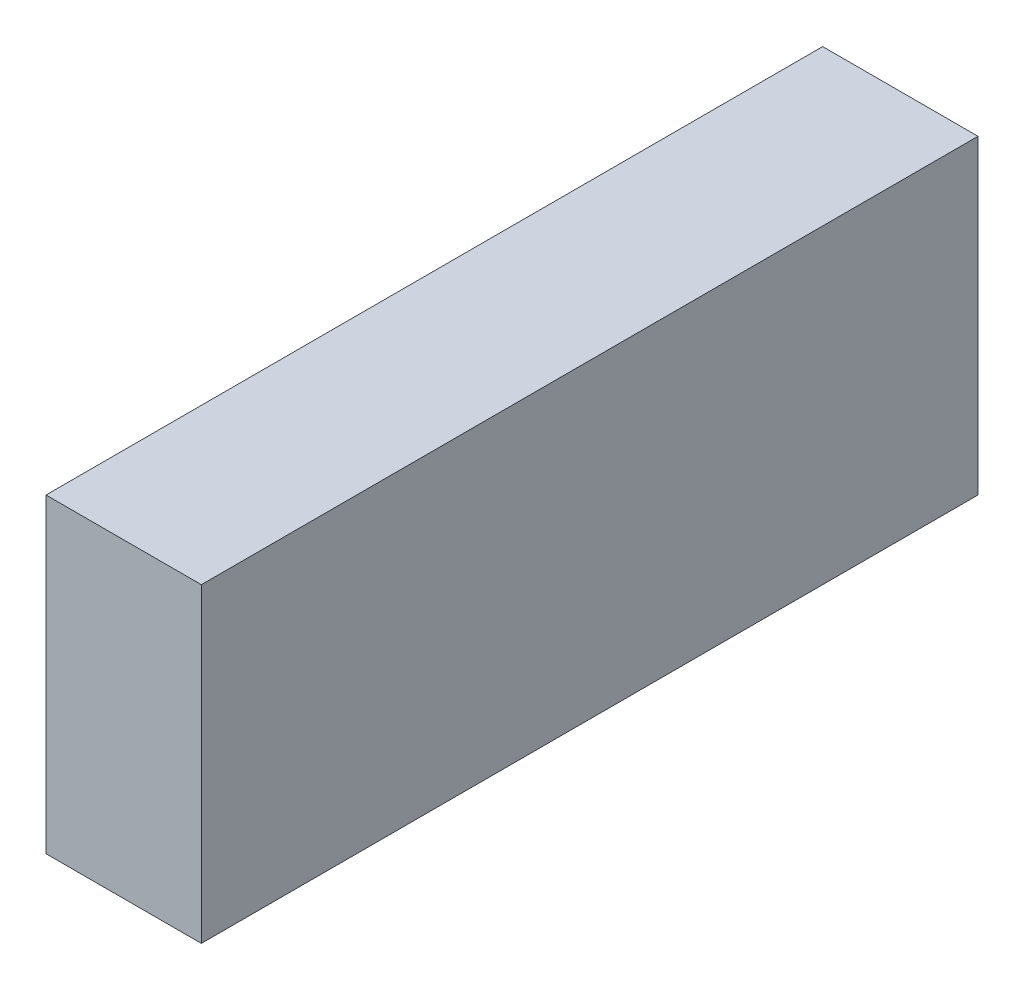
ISO-10303-21;
HEADER;
FILE_DESCRIPTION(('STEP AP214'),'2;1');
FILE_NAME('part.step','',(''),(''),'','','');
FILE_SCHEMA(('AUTOMOTIVE_DESIGN { 1 0 10303 214 1 1 1 1 }'));
ENDSEC;
DATA;
#1=APPLICATION_CONTEXT('core data for automotive mechanical design processes');
#2=APPLICATION_PROTOCOL_DEFINITION('international standard','automotive_design',2000,#1);
#3=PRODUCT_CONTEXT('',#1,'mechanical');
#4=PRODUCT('Part','Part','',(#3));
#5=PRODUCT_RELATED_PRODUCT_CATEGORY('part','',(#4));
#6=PRODUCT_DEFINITION_FORMATION('','',#4);
#7=PRODUCT_DEFINITION_CONTEXT('part definition',#1,'design');
#8=PRODUCT_DEFINITION('design','',#6,#7);
#9=PRODUCT_DEFINITION_SHAPE('','',#8);
#10=(LENGTH_UNIT() NAMED_UNIT(*) SI_UNIT(.MILLI.,.METRE.));
#11=(NAMED_UNIT(*) PLANE_ANGLE_UNIT() SI_UNIT($,.RADIAN.));
#12=(NAMED_UNIT(*) SI_UNIT($,.STERADIAN.) SOLID_ANGLE_UNIT());
#13=UNCERTAINTY_MEASURE_WITH_UNIT(LENGTH_MEASURE(1.E-05),#10,'distance_accuracy_value','');
#14=(GEOMETRIC_REPRESENTATION_CONTEXT(3) GLOBAL_UNCERTAINTY_ASSIGNED_CONTEXT((#13)) GLOBAL_UNIT_ASSIGNED_CONTEXT((#10,
#11,#12)) REPRESENTATION_CONTEXT('',''));
#15=CARTESIAN_POINT('',(0.,0.,0.));
#16=DIRECTION('',(0.,0.,1.));
#17=DIRECTION('',(1.,0.,0.));
#18=AXIS2_PLACEMENT_3D('',#15,#16,#17);
#19=CARTESIAN_POINT('',(0.,0.,50.));
#20=DIRECTION('',(1.,0.,0.));
#21=DIRECTION('',(0.,0.,-1.));
#22=AXIS2_PLACEMENT_3D('',#19,#20,#21);
#23=PLANE('',#22);
#24=DIRECTION('',(0.,-1.,0.));
#25=VECTOR('',#24,1.);
#26=CARTESIAN_POINT('',(0.,0.,0.));
#27=LINE('',#26,#25);
#28=CARTESIAN_POINT('',(0.,20.,0.));
#29=VERTEX_POINT('',#28);
#30=CARTESIAN_POINT('',(0.,0.,0.));
#31=VERTEX_POINT('',#30);
#32=EDGE_CURVE('E101',#29,#31,#27,.T.);
#33=ORIENTED_EDGE('',*,*,#32,.T.);
#34=DIRECTION('',(0.,0.,-1.));
#35=VECTOR('',#34,1.);
#36=CARTESIAN_POINT('',(0.,0.,50.));
#37=LINE('',#36,#35);
#38=CARTESIAN_POINT('',(0.,0.,50.));
#39=VERTEX_POINT('',#38);
#40=EDGE_CURVE('E12',#39,#31,#37,.T.);
#41=ORIENTED_EDGE('',*,*,#40,.F.);
#42=DIRECTION('',(0.,-1.,0.));
#43=VECTOR('',#42,1.);
#44=CARTESIAN_POINT('',(0.,0.,50.));
#45=LINE('',#44,#43);
#46=CARTESIAN_POINT('',(0.,20.,50.));
#47=VERTEX_POINT('',#46);
#48=EDGE_CURVE('E89',#47,#39,#45,.T.);
#49=ORIENTED_EDGE('',*,*,#48,.F.);
#50=DIRECTION('',(0.,0.,-1.));
#51=VECTOR('',#50,1.);
#52=CARTESIAN_POINT('',(0.,20.,50.));
#53=LINE('',#52,#51);
#54=EDGE_CURVE('E97',#47,#29,#53,.T.);
#55=ORIENTED_EDGE('',*,*,#54,.T.);
#56=EDGE_LOOP('',(#33,#41,#49,#55));
#57=FACE_BOUND('',#56,.T.);
#58=ADVANCED_FACE('F38',(#57),#23,.F.);
#59=CARTESIAN_POINT('',(0.,0.,50.));
#60=DIRECTION('',(0.,1.,0.));
#61=DIRECTION('',(0.,0.,1.));
#62=AXIS2_PLACEMENT_3D('',#59,#60,#61);
#63=PLANE('',#62);
#64=DIRECTION('',(1.,0.,0.));
#65=VECTOR('',#64,1.);
#66=CARTESIAN_POINT('',(0.,0.,0.));
#67=LINE('',#66,#65);
#68=CARTESIAN_POINT('',(10.,0.,0.));
#69=VERTEX_POINT('',#68);
#70=EDGE_CURVE('E93',#31,#69,#67,.T.);
#71=ORIENTED_EDGE('',*,*,#70,.T.);
#72=DIRECTION('',(0.,0.,-1.));
#73=VECTOR('',#72,1.);
#74=CARTESIAN_POINT('',(10.,0.,50.));
#75=LINE('',#74,#73);
#76=CARTESIAN_POINT('',(10.,0.,50.));
#77=VERTEX_POINT('',#76);
#78=EDGE_CURVE('E46',#77,#69,#75,.T.);
#79=ORIENTED_EDGE('',*,*,#78,.F.);
#80=DIRECTION('',(1.,0.,0.));
#81=VECTOR('',#80,1.);
#82=CARTESIAN_POINT('',(0.,0.,50.));
#83=LINE('',#82,#81);
#84=EDGE_CURVE('E84',#39,#77,#83,.T.);
#85=ORIENTED_EDGE('',*,*,#84,.F.);
#86=ORIENTED_EDGE('',*,*,#40,.T.);
#87=EDGE_LOOP('',(#71,#79,#85,#86));
#88=FACE_BOUND('',#87,.T.);
#89=ADVANCED_FACE('F92',(#88),#63,.F.);
#90=CARTESIAN_POINT('',(10.,0.,50.));
#91=DIRECTION('',(-1.,0.,0.));
#92=DIRECTION('',(0.,0.,1.));
#93=AXIS2_PLACEMENT_3D('',#90,#91,#92);
#94=PLANE('',#93);
#95=DIRECTION('',(0.,1.,0.));
#96=VECTOR('',#95,1.);
#97=CARTESIAN_POINT('',(10.,0.,0.));
#98=LINE('',#97,#96);
#99=CARTESIAN_POINT('',(10.,20.,0.));
#100=VERTEX_POINT('',#99);
#101=EDGE_CURVE('E71',#69,#100,#98,.T.);
#102=ORIENTED_EDGE('',*,*,#101,.T.);
#103=DIRECTION('',(0.,0.,-1.));
#104=VECTOR('',#103,1.);
#105=CARTESIAN_POINT('',(10.,20.,50.));
#106=LINE('',#105,#104);
#107=CARTESIAN_POINT('',(10.,20.,50.));
#108=VERTEX_POINT('',#107);
#109=EDGE_CURVE('E94',#108,#100,#106,.T.);
#110=ORIENTED_EDGE('',*,*,#109,.F.);
#111=DIRECTION('',(0.,1.,0.));
#112=VECTOR('',#111,1.);
#113=CARTESIAN_POINT('',(10.,0.,50.));
#114=LINE('',#113,#112);
#115=EDGE_CURVE('E87',#77,#108,#114,.T.);
#116=ORIENTED_EDGE('',*,*,#115,.F.);
#117=ORIENTED_EDGE('',*,*,#78,.T.);
#118=EDGE_LOOP('',(#102,#110,#116,#117));
#119=FACE_BOUND('',#118,.T.);
#120=ADVANCED_FACE('F95',(#119),#94,.F.);
#121=CARTESIAN_POINT('',(0.,20.,50.));
#122=DIRECTION('',(0.,-1.,0.));
#123=DIRECTION('',(0.,0.,-1.));
#124=AXIS2_PLACEMENT_3D('',#121,#122,#123);
#125=PLANE('',#124);
#126=DIRECTION('',(-1.,0.,0.));
#127=VECTOR('',#126,1.);
#128=CARTESIAN_POINT('',(0.,20.,0.));
#129=LINE('',#128,#127);
#130=EDGE_CURVE('E77',#100,#29,#129,.T.);
#131=ORIENTED_EDGE('',*,*,#130,.T.);
#132=ORIENTED_EDGE('',*,*,#54,.F.);
#133=DIRECTION('',(-1.,0.,0.));
#134=VECTOR('',#133,1.);
#135=CARTESIAN_POINT('',(0.,20.,50.));
#136=LINE('',#135,#134);
#137=EDGE_CURVE('E54',#108,#47,#136,.T.);
#138=ORIENTED_EDGE('',*,*,#137,.F.);
#139=ORIENTED_EDGE('',*,*,#109,.T.);
#140=EDGE_LOOP('',(#131,#132,#138,#139));
#141=FACE_BOUND('',#140,.T.);
#142=ADVANCED_FACE('F108',(#141),#125,.F.);
#143=CARTESIAN_POINT('',(0.,20.,50.));
#144=DIRECTION('',(0.,0.,-1.));
#145=DIRECTION('',(-1.,0.,0.));
#146=AXIS2_PLACEMENT_3D('',#143,#144,#145);
#147=PLANE('',#146);
#148=ORIENTED_EDGE('',*,*,#48,.T.);
#149=ORIENTED_EDGE('',*,*,#84,.T.);
#150=ORIENTED_EDGE('',*,*,#115,.T.);
#151=ORIENTED_EDGE('',*,*,#137,.T.);
#152=EDGE_LOOP('',(#148,#149,#150,#151));
#153=FACE_BOUND('',#152,.T.);
#154=ADVANCED_FACE('F85',(#153),#147,.F.);
#155=CARTESIAN_POINT('',(0.,20.,0.));
#156=DIRECTION('',(0.,0.,-1.));
#157=DIRECTION('',(-1.,0.,0.));
#158=AXIS2_PLACEMENT_3D('',#155,#156,#157);
#159=PLANE('',#158);
#160=ORIENTED_EDGE('',*,*,#32,.F.);
#161=ORIENTED_EDGE('',*,*,#130,.F.);
#162=ORIENTED_EDGE('',*,*,#101,.F.);
#163=ORIENTED_EDGE('',*,*,#70,.F.);
#164=EDGE_LOOP('',(#160,#161,#162,#163));
#165=FACE_BOUND('',#164,.T.);
#166=ADVANCED_FACE('F111',(#165),#159,.T.);
#167=CLOSED_SHELL('',(#58,#89,#120,#142,#154,#166));
#168=MANIFOLD_SOLID_BREP('B2',#167);
#169=ADVANCED_BREP_SHAPE_REPRESENTATION('',(#18,#168),#14);
#170=SHAPE_DEFINITION_REPRESENTATION(#9,#169);
ENDSEC;
END-ISO-10303-21;
